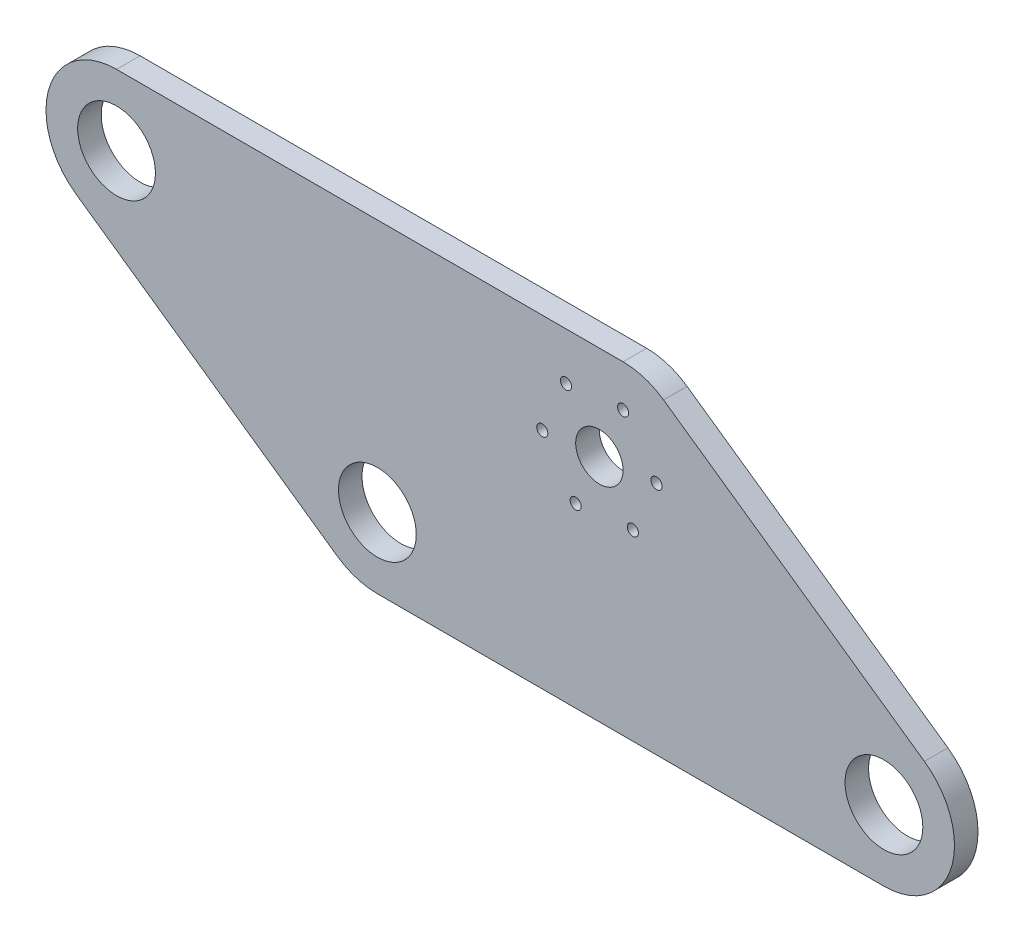
ISO-10303-21;
HEADER;
FILE_DESCRIPTION(('STEP AP214'),'2;1');
FILE_NAME('part.step','',(''),(''),'','','');
FILE_SCHEMA(('AUTOMOTIVE_DESIGN { 1 0 10303 214 1 1 1 1 }'));
ENDSEC;
DATA;
#1=APPLICATION_CONTEXT('core data for automotive mechanical design processes');
#2=APPLICATION_PROTOCOL_DEFINITION('international standard','automotive_design',2000,#1);
#3=PRODUCT_CONTEXT('',#1,'mechanical');
#4=PRODUCT('Part','Part','',(#3));
#5=PRODUCT_RELATED_PRODUCT_CATEGORY('part','',(#4));
#6=PRODUCT_DEFINITION_FORMATION('','',#4);
#7=PRODUCT_DEFINITION_CONTEXT('part definition',#1,'design');
#8=PRODUCT_DEFINITION('design','',#6,#7);
#9=PRODUCT_DEFINITION_SHAPE('','',#8);
#10=(LENGTH_UNIT() NAMED_UNIT(*) SI_UNIT(.MILLI.,.METRE.));
#11=(NAMED_UNIT(*) PLANE_ANGLE_UNIT() SI_UNIT($,.RADIAN.));
#12=(NAMED_UNIT(*) SI_UNIT($,.STERADIAN.) SOLID_ANGLE_UNIT());
#13=UNCERTAINTY_MEASURE_WITH_UNIT(LENGTH_MEASURE(1.E-05),#10,'distance_accuracy_value','');
#14=(GEOMETRIC_REPRESENTATION_CONTEXT(3) GLOBAL_UNCERTAINTY_ASSIGNED_CONTEXT((#13)) GLOBAL_UNIT_ASSIGNED_CONTEXT((#10,
#11,#12)) REPRESENTATION_CONTEXT('',''));
#15=CARTESIAN_POINT('',(0.,0.,0.));
#16=DIRECTION('',(0.,0.,1.));
#17=DIRECTION('',(1.,0.,0.));
#18=AXIS2_PLACEMENT_3D('',#15,#16,#17);
#19=CARTESIAN_POINT('',(-27.5612284503571,-62.0130488998987,-6.35));
#20=DIRECTION('',(0.573576436351041,0.819152044288995,0.));
#21=DIRECTION('',(-0.819152044288995,0.573576436351041,0.));
#22=AXIS2_PLACEMENT_3D('',#19,#20,#21);
#23=PLANE('',#22);
#24=DIRECTION('',(0.819152044288995,-0.573576436351041,0.));
#25=VECTOR('',#24,1.);
#26=CARTESIAN_POINT('',(-27.5612284503571,-62.0130488998987,0.));
#27=LINE('',#26,#25);
#28=CARTESIAN_POINT('',(-102.907750127468,-9.25484644370535,0.));
#29=VERTEX_POINT('',#28);
#30=CARTESIAN_POINT('',(-32.4814176346999,-58.5678953436041,0.));
#31=VERTEX_POINT('',#30);
#32=EDGE_CURVE('E168',#29,#31,#27,.T.);
#33=ORIENTED_EDGE('',*,*,#32,.F.);
#34=DIRECTION('',(0.,0.,1.));
#35=VECTOR('',#34,1.);
#36=CARTESIAN_POINT('',(-102.907750127468,-9.25484644370535,-6.35));
#37=LINE('',#36,#35);
#38=CARTESIAN_POINT('',(-102.907750127468,-9.25484644370535,-6.35));
#39=VERTEX_POINT('',#38);
#40=EDGE_CURVE('E49',#39,#29,#37,.T.);
#41=ORIENTED_EDGE('',*,*,#40,.F.);
#42=DIRECTION('',(0.819152044288995,-0.573576436351041,0.));
#43=VECTOR('',#42,1.);
#44=CARTESIAN_POINT('',(-27.5612284503571,-62.0130488998987,-6.35));
#45=LINE('',#44,#43);
#46=CARTESIAN_POINT('',(-32.4814176346999,-58.5678953436041,-6.35));
#47=VERTEX_POINT('',#46);
#48=EDGE_CURVE('E133',#39,#47,#45,.T.);
#49=ORIENTED_EDGE('',*,*,#48,.T.);
#50=DIRECTION('',(0.,0.,1.));
#51=VECTOR('',#50,1.);
#52=CARTESIAN_POINT('',(-32.4814176346999,-58.5678953436041,-6.35));
#53=LINE('',#52,#51);
#54=EDGE_CURVE('E11',#31,#47,#53,.F.);
#55=ORIENTED_EDGE('',*,*,#54,.F.);
#56=EDGE_LOOP('',(#33,#41,#49,#55));
#57=FACE_BOUND('',#56,.T.);
#58=ADVANCED_FACE('F41',(#57),#23,.F.);
#59=CARTESIAN_POINT('',(175.638771549643,-62.0130488998987,-6.35));
#60=DIRECTION('',(0.,1.,0.));
#61=DIRECTION('',(-1.,0.,0.));
#62=AXIS2_PLACEMENT_3D('',#59,#60,#61);
#63=PLANE('',#62);
#64=DIRECTION('',(1.,0.,0.));
#65=VECTOR('',#64,1.);
#66=CARTESIAN_POINT('',(175.638771549643,-62.0130488998987,-6.35));
#67=LINE('',#66,#65);
#68=CARTESIAN_POINT('',(-21.5547865222126,-62.0130488998987,-6.35));
#69=VERTEX_POINT('',#68);
#70=CARTESIAN_POINT('',(115.219890564623,-62.0130488998987,-6.35));
#71=VERTEX_POINT('',#70);
#72=EDGE_CURVE('E136',#69,#71,#67,.T.);
#73=ORIENTED_EDGE('',*,*,#72,.T.);
#74=DIRECTION('',(0.,0.,1.));
#75=VECTOR('',#74,1.);
#76=CARTESIAN_POINT('',(115.219890564623,-62.0130488998987,-6.35));
#77=LINE('',#76,#75);
#78=CARTESIAN_POINT('',(115.219890564623,-62.0130488998987,0.));
#79=VERTEX_POINT('',#78);
#80=EDGE_CURVE('E157',#79,#71,#77,.F.);
#81=ORIENTED_EDGE('',*,*,#80,.F.);
#82=DIRECTION('',(1.,0.,0.));
#83=VECTOR('',#82,1.);
#84=CARTESIAN_POINT('',(175.638771549643,-62.0130488998987,0.));
#85=LINE('',#84,#83);
#86=CARTESIAN_POINT('',(-21.5547865222126,-62.0130488998987,0.));
#87=VERTEX_POINT('',#86);
#88=EDGE_CURVE('E138',#87,#79,#85,.T.);
#89=ORIENTED_EDGE('',*,*,#88,.F.);
#90=DIRECTION('',(0.,0.,1.));
#91=VECTOR('',#90,1.);
#92=CARTESIAN_POINT('',(-21.5547865222126,-62.0130488998987,-6.35));
#93=LINE('',#92,#91);
#94=EDGE_CURVE('E159',#69,#87,#93,.T.);
#95=ORIENTED_EDGE('',*,*,#94,.F.);
#96=EDGE_LOOP('',(#73,#81,#89,#95));
#97=FACE_BOUND('',#96,.T.);
#98=ADVANCED_FACE('F254',(#97),#63,.F.);
#99=CARTESIAN_POINT('',(50.8,25.4,-6.35));
#100=DIRECTION('',(-0.573576436351041,-0.819152044288995,0.));
#101=DIRECTION('',(0.819152044288995,-0.573576436351041,0.));
#102=AXIS2_PLACEMENT_3D('',#99,#100,#101);
#103=PLANE('',#102);
#104=DIRECTION('',(-0.819152044288995,0.573576436351041,0.));
#105=VECTOR('',#104,1.);
#106=CARTESIAN_POINT('',(50.8,25.4,0.));
#107=LINE('',#106,#105);
#108=CARTESIAN_POINT('',(126.14652167711,-27.3582024561934,0.));
#109=VERTEX_POINT('',#108);
#110=CARTESIAN_POINT('',(55.7201891843428,21.9548464437054,0.));
#111=VERTEX_POINT('',#110);
#112=EDGE_CURVE('E114',#109,#111,#107,.T.);
#113=ORIENTED_EDGE('',*,*,#112,.F.);
#114=DIRECTION('',(0.,0.,1.));
#115=VECTOR('',#114,1.);
#116=CARTESIAN_POINT('',(126.14652167711,-27.3582024561934,-6.35));
#117=LINE('',#116,#115);
#118=CARTESIAN_POINT('',(126.14652167711,-27.3582024561934,-6.35));
#119=VERTEX_POINT('',#118);
#120=EDGE_CURVE('E118',#119,#109,#117,.T.);
#121=ORIENTED_EDGE('',*,*,#120,.F.);
#122=DIRECTION('',(-0.819152044288995,0.573576436351041,0.));
#123=VECTOR('',#122,1.);
#124=CARTESIAN_POINT('',(50.8,25.4,-6.35));
#125=LINE('',#124,#123);
#126=CARTESIAN_POINT('',(55.7201891843428,21.9548464437054,-6.35));
#127=VERTEX_POINT('',#126);
#128=EDGE_CURVE('E177',#119,#127,#125,.T.);
#129=ORIENTED_EDGE('',*,*,#128,.T.);
#130=DIRECTION('',(0.,0.,1.));
#131=VECTOR('',#130,1.);
#132=CARTESIAN_POINT('',(55.7201891843428,21.9548464437054,-6.35));
#133=LINE('',#132,#131);
#134=EDGE_CURVE('E150',#111,#127,#133,.F.);
#135=ORIENTED_EDGE('',*,*,#134,.F.);
#136=EDGE_LOOP('',(#113,#121,#129,#135));
#137=FACE_BOUND('',#136,.T.);
#138=ADVANCED_FACE('F259',(#137),#103,.F.);
#139=CARTESIAN_POINT('',(-152.4,25.4,-6.35));
#140=DIRECTION('',(0.,-1.,0.));
#141=DIRECTION('',(0.,0.,1.));
#142=AXIS2_PLACEMENT_3D('',#139,#140,#141);
#143=PLANE('',#142);
#144=DIRECTION('',(-1.,0.,0.));
#145=VECTOR('',#144,1.);
#146=CARTESIAN_POINT('',(-152.4,25.4,-6.35));
#147=LINE('',#146,#145);
#148=CARTESIAN_POINT('',(44.7935580718554,25.4,-6.35));
#149=VERTEX_POINT('',#148);
#150=CARTESIAN_POINT('',(-91.9811190149802,25.4,-6.35));
#151=VERTEX_POINT('',#150);
#152=EDGE_CURVE('E142',#149,#151,#147,.T.);
#153=ORIENTED_EDGE('',*,*,#152,.T.);
#154=DIRECTION('',(0.,0.,1.));
#155=VECTOR('',#154,1.);
#156=CARTESIAN_POINT('',(-91.9811190149802,25.4,-6.35));
#157=LINE('',#156,#155);
#158=CARTESIAN_POINT('',(-91.9811190149802,25.4,0.));
#159=VERTEX_POINT('',#158);
#160=EDGE_CURVE('E129',#159,#151,#157,.F.);
#161=ORIENTED_EDGE('',*,*,#160,.F.);
#162=DIRECTION('',(-1.,0.,0.));
#163=VECTOR('',#162,1.);
#164=CARTESIAN_POINT('',(-152.4,25.4,0.));
#165=LINE('',#164,#163);
#166=CARTESIAN_POINT('',(44.7935580718554,25.4,0.));
#167=VERTEX_POINT('',#166);
#168=EDGE_CURVE('E111',#167,#159,#165,.T.);
#169=ORIENTED_EDGE('',*,*,#168,.F.);
#170=DIRECTION('',(0.,0.,1.));
#171=VECTOR('',#170,1.);
#172=CARTESIAN_POINT('',(44.7935580718554,25.4,-6.35));
#173=LINE('',#172,#171);
#174=EDGE_CURVE('E122',#149,#167,#173,.T.);
#175=ORIENTED_EDGE('',*,*,#174,.F.);
#176=EDGE_LOOP('',(#153,#161,#169,#175));
#177=FACE_BOUND('',#176,.T.);
#178=ADVANCED_FACE('F131',(#177),#143,.F.);
#179=CARTESIAN_POINT('',(0.,0.,-6.35));
#180=DIRECTION('',(0.,0.,1.));
#181=DIRECTION('',(-1.,0.,0.));
#182=AXIS2_PLACEMENT_3D('',#179,#180,#181);
#183=PLANE('',#182);
#184=CARTESIAN_POINT('',(-91.9811190149802,6.35,-6.35));
#185=DIRECTION('',(0.,0.,1.));
#186=DIRECTION('',(1.,0.,0.));
#187=AXIS2_PLACEMENT_3D('',#184,#185,#186);
#188=CIRCLE('',#187,10.5);
#189=CARTESIAN_POINT('',(-81.4811190149802,6.35,-6.35));
#190=VERTEX_POINT('',#189);
#191=EDGE_CURVE('E173',#190,#190,#188,.T.);
#192=ORIENTED_EDGE('',*,*,#191,.T.);
#193=EDGE_LOOP('',(#192));
#194=FACE_BOUND('',#193,.T.);
#195=CARTESIAN_POINT('',(29.367867907288,12.6010680917624,-6.35));
#196=DIRECTION('',(0.,0.,1.));
#197=DIRECTION('',(1.,0.,0.));
#198=AXIS2_PLACEMENT_3D('',#195,#196,#197);
#199=CIRCLE('',#198,1.50000000000001);
#200=CARTESIAN_POINT('',(30.867867907288,12.6010680917624,-6.35));
#201=VERTEX_POINT('',#200);
#202=EDGE_CURVE('E211',#201,#201,#199,.T.);
#203=ORIENTED_EDGE('',*,*,#202,.T.);
#204=EDGE_LOOP('',(#203));
#205=FACE_BOUND('',#204,.T.);
#206=CARTESIAN_POINT('',(44.7935580718554,14.1170110150839,-6.35));
#207=DIRECTION('',(0.,0.,1.));
#208=DIRECTION('',(1.,0.,0.));
#209=AXIS2_PLACEMENT_3D('',#206,#207,#208);
#210=CIRCLE('',#209,1.5);
#211=CARTESIAN_POINT('',(46.2935580718554,14.1170110150839,-6.35));
#212=VERTEX_POINT('',#211);
#213=EDGE_CURVE('E198',#212,#212,#210,.T.);
#214=ORIENTED_EDGE('',*,*,#213,.T.);
#215=EDGE_LOOP('',(#214));
#216=FACE_BOUND('',#215,.T.);
#217=CARTESIAN_POINT('',(115.219890564623,-42.9630488998987,-6.35));
#218=DIRECTION('',(0.,0.,1.));
#219=DIRECTION('',(1.,0.,0.));
#220=AXIS2_PLACEMENT_3D('',#217,#218,#219);
#221=CIRCLE('',#220,10.5);
#222=CARTESIAN_POINT('',(125.719890564623,-42.9630488998987,-6.35));
#223=VERTEX_POINT('',#222);
#224=EDGE_CURVE('E186',#223,#223,#221,.T.);
#225=ORIENTED_EDGE('',*,*,#224,.T.);
#226=EDGE_LOOP('',(#225));
#227=FACE_BOUND('',#226,.T.);
#228=CARTESIAN_POINT('',(-21.5547865222126,-42.9630488998987,-6.35));
#229=DIRECTION('',(0.,0.,1.));
#230=DIRECTION('',(1.,0.,0.));
#231=AXIS2_PLACEMENT_3D('',#228,#229,#230);
#232=CIRCLE('',#231,10.5);
#233=CARTESIAN_POINT('',(-11.0547865222126,-42.9630488998987,-6.35));
#234=VERTEX_POINT('',#233);
#235=EDGE_CURVE('E185',#234,#234,#232,.T.);
#236=ORIENTED_EDGE('',*,*,#235,.T.);
#237=EDGE_LOOP('',(#236));
#238=FACE_BOUND('',#237,.T.);
#239=CARTESIAN_POINT('',(38.3935580718554,0.,-6.35));
#240=DIRECTION('',(0.,0.,1.));
#241=DIRECTION('',(1.,0.,0.));
#242=AXIS2_PLACEMENT_3D('',#239,#240,#241);
#243=CIRCLE('',#242,6.40000000000001);
#244=CARTESIAN_POINT('',(44.7935580718554,0.,-6.35));
#245=VERTEX_POINT('',#244);
#246=EDGE_CURVE('E192',#245,#245,#243,.T.);
#247=ORIENTED_EDGE('',*,*,#246,.T.);
#248=EDGE_LOOP('',(#247));
#249=FACE_BOUND('',#248,.T.);
#250=CARTESIAN_POINT('',(53.8192482364228,1.51594292332154,-6.35));
#251=DIRECTION('',(0.,0.,1.));
#252=DIRECTION('',(1.,0.,0.));
#253=AXIS2_PLACEMENT_3D('',#250,#251,#252);
#254=CIRCLE('',#253,1.5);
#255=CARTESIAN_POINT('',(55.3192482364228,1.51594292332154,-6.35));
#256=VERTEX_POINT('',#255);
#257=EDGE_CURVE('E199',#256,#256,#254,.T.);
#258=ORIENTED_EDGE('',*,*,#257,.T.);
#259=EDGE_LOOP('',(#258));
#260=FACE_BOUND('',#259,.T.);
#261=CARTESIAN_POINT('',(47.4192482364228,-12.6010680917623,-6.35));
#262=DIRECTION('',(0.,0.,1.));
#263=DIRECTION('',(1.,0.,0.));
#264=AXIS2_PLACEMENT_3D('',#261,#262,#263);
#265=CIRCLE('',#264,1.50000000000001);
#266=CARTESIAN_POINT('',(48.9192482364228,-12.6010680917623,-6.35));
#267=VERTEX_POINT('',#266);
#268=EDGE_CURVE('E223',#267,#267,#265,.T.);
#269=ORIENTED_EDGE('',*,*,#268,.T.);
#270=EDGE_LOOP('',(#269));
#271=FACE_BOUND('',#270,.T.);
#272=CARTESIAN_POINT('',(31.9935580718554,-14.1170110150839,-6.35));
#273=DIRECTION('',(0.,0.,1.));
#274=DIRECTION('',(1.,0.,0.));
#275=AXIS2_PLACEMENT_3D('',#272,#273,#274);
#276=CIRCLE('',#275,1.5);
#277=CARTESIAN_POINT('',(33.4935580718554,-14.1170110150839,-6.35));
#278=VERTEX_POINT('',#277);
#279=EDGE_CURVE('E217',#278,#278,#276,.T.);
#280=ORIENTED_EDGE('',*,*,#279,.T.);
#281=EDGE_LOOP('',(#280));
#282=FACE_BOUND('',#281,.T.);
#283=CARTESIAN_POINT('',(22.967867907288,-1.51594292332154,-6.35));
#284=DIRECTION('',(0.,0.,1.));
#285=DIRECTION('',(1.,0.,0.));
#286=AXIS2_PLACEMENT_3D('',#283,#284,#285);
#287=CIRCLE('',#286,1.5);
#288=CARTESIAN_POINT('',(24.467867907288,-1.51594292332154,-6.35));
#289=VERTEX_POINT('',#288);
#290=EDGE_CURVE('E210',#289,#289,#287,.T.);
#291=ORIENTED_EDGE('',*,*,#290,.T.);
#292=EDGE_LOOP('',(#291));
#293=FACE_BOUND('',#292,.T.);
#294=ORIENTED_EDGE('',*,*,#128,.F.);
#295=CARTESIAN_POINT('',(115.219890564623,-42.9630488998987,-6.35));
#296=DIRECTION('',(0.,0.,-1.));
#297=DIRECTION('',(-1.,0.,0.));
#298=AXIS2_PLACEMENT_3D('',#295,#296,#297);
#299=CIRCLE('',#298,19.05);
#300=EDGE_CURVE('E56',#71,#119,#299,.F.);
#301=ORIENTED_EDGE('',*,*,#300,.F.);
#302=ORIENTED_EDGE('',*,*,#72,.F.);
#303=CARTESIAN_POINT('',(-21.5547865222126,-42.9630488998987,-6.35));
#304=DIRECTION('',(0.,0.,-1.));
#305=DIRECTION('',(-1.,0.,0.));
#306=AXIS2_PLACEMENT_3D('',#303,#304,#305);
#307=CIRCLE('',#306,19.05);
#308=EDGE_CURVE('E63',#47,#69,#307,.F.);
#309=ORIENTED_EDGE('',*,*,#308,.F.);
#310=ORIENTED_EDGE('',*,*,#48,.F.);
#311=CARTESIAN_POINT('',(-91.9811190149802,6.35,-6.35));
#312=DIRECTION('',(0.,0.,-1.));
#313=DIRECTION('',(-1.,0.,0.));
#314=AXIS2_PLACEMENT_3D('',#311,#312,#313);
#315=CIRCLE('',#314,19.05);
#316=EDGE_CURVE('E152',#151,#39,#315,.F.);
#317=ORIENTED_EDGE('',*,*,#316,.F.);
#318=ORIENTED_EDGE('',*,*,#152,.F.);
#319=CARTESIAN_POINT('',(44.7935580718554,6.35,-6.35));
#320=DIRECTION('',(0.,0.,-1.));
#321=DIRECTION('',(-1.,0.,0.));
#322=AXIS2_PLACEMENT_3D('',#319,#320,#321);
#323=CIRCLE('',#322,19.05);
#324=EDGE_CURVE('E124',#127,#149,#323,.F.);
#325=ORIENTED_EDGE('',*,*,#324,.F.);
#326=EDGE_LOOP('',(#294,#301,#302,#309,#310,#317,#318,#325));
#327=FACE_BOUND('',#326,.T.);
#328=ADVANCED_FACE('F239',(#194,#205,#216,#227,#238,#249,#260,#271,#282,#293,#327),#183,.F.);
#329=CARTESIAN_POINT('',(0.,0.,0.));
#330=DIRECTION('',(0.,0.,1.));
#331=DIRECTION('',(-1.,0.,0.));
#332=AXIS2_PLACEMENT_3D('',#329,#330,#331);
#333=PLANE('',#332);
#334=CARTESIAN_POINT('',(-91.9811190149802,6.35,0.));
#335=DIRECTION('',(0.,0.,1.));
#336=DIRECTION('',(1.,0.,0.));
#337=AXIS2_PLACEMENT_3D('',#334,#335,#336);
#338=CIRCLE('',#337,10.5);
#339=CARTESIAN_POINT('',(-81.4811190149802,6.35,0.));
#340=VERTEX_POINT('',#339);
#341=EDGE_CURVE('E169',#340,#340,#338,.T.);
#342=ORIENTED_EDGE('',*,*,#341,.F.);
#343=EDGE_LOOP('',(#342));
#344=FACE_BOUND('',#343,.T.);
#345=CARTESIAN_POINT('',(29.367867907288,12.6010680917624,0.));
#346=DIRECTION('',(0.,0.,1.));
#347=DIRECTION('',(1.,0.,0.));
#348=AXIS2_PLACEMENT_3D('',#345,#346,#347);
#349=CIRCLE('',#348,1.50000000000001);
#350=CARTESIAN_POINT('',(30.867867907288,12.6010680917624,0.));
#351=VERTEX_POINT('',#350);
#352=EDGE_CURVE('E231',#351,#351,#349,.T.);
#353=ORIENTED_EDGE('',*,*,#352,.F.);
#354=EDGE_LOOP('',(#353));
#355=FACE_BOUND('',#354,.T.);
#356=CARTESIAN_POINT('',(44.7935580718554,14.1170110150839,0.));
#357=DIRECTION('',(0.,0.,1.));
#358=DIRECTION('',(1.,0.,0.));
#359=AXIS2_PLACEMENT_3D('',#356,#357,#358);
#360=CIRCLE('',#359,1.5);
#361=CARTESIAN_POINT('',(46.2935580718554,14.1170110150839,0.));
#362=VERTEX_POINT('',#361);
#363=EDGE_CURVE('E195',#362,#362,#360,.T.);
#364=ORIENTED_EDGE('',*,*,#363,.F.);
#365=EDGE_LOOP('',(#364));
#366=FACE_BOUND('',#365,.T.);
#367=CARTESIAN_POINT('',(115.219890564623,-42.9630488998987,0.));
#368=DIRECTION('',(0.,0.,1.));
#369=DIRECTION('',(1.,0.,0.));
#370=AXIS2_PLACEMENT_3D('',#367,#368,#369);
#371=CIRCLE('',#370,10.5);
#372=CARTESIAN_POINT('',(125.719890564623,-42.9630488998987,0.));
#373=VERTEX_POINT('',#372);
#374=EDGE_CURVE('E202',#373,#373,#371,.T.);
#375=ORIENTED_EDGE('',*,*,#374,.F.);
#376=EDGE_LOOP('',(#375));
#377=FACE_BOUND('',#376,.T.);
#378=CARTESIAN_POINT('',(-21.5547865222126,-42.9630488998987,0.));
#379=DIRECTION('',(0.,0.,1.));
#380=DIRECTION('',(1.,0.,0.));
#381=AXIS2_PLACEMENT_3D('',#378,#379,#380);
#382=CIRCLE('',#381,10.5);
#383=CARTESIAN_POINT('',(-11.0547865222126,-42.9630488998987,0.));
#384=VERTEX_POINT('',#383);
#385=EDGE_CURVE('E182',#384,#384,#382,.T.);
#386=ORIENTED_EDGE('',*,*,#385,.F.);
#387=EDGE_LOOP('',(#386));
#388=FACE_BOUND('',#387,.T.);
#389=CARTESIAN_POINT('',(38.3935580718554,0.,0.));
#390=DIRECTION('',(0.,0.,1.));
#391=DIRECTION('',(1.,0.,0.));
#392=AXIS2_PLACEMENT_3D('',#389,#390,#391);
#393=CIRCLE('',#392,6.40000000000001);
#394=CARTESIAN_POINT('',(44.7935580718554,0.,0.));
#395=VERTEX_POINT('',#394);
#396=EDGE_CURVE('E189',#395,#395,#393,.T.);
#397=ORIENTED_EDGE('',*,*,#396,.F.);
#398=EDGE_LOOP('',(#397));
#399=FACE_BOUND('',#398,.T.);
#400=CARTESIAN_POINT('',(53.8192482364228,1.51594292332154,0.));
#401=DIRECTION('',(0.,0.,1.));
#402=DIRECTION('',(1.,0.,0.));
#403=AXIS2_PLACEMENT_3D('',#400,#401,#402);
#404=CIRCLE('',#403,1.5);
#405=CARTESIAN_POINT('',(55.3192482364228,1.51594292332154,0.));
#406=VERTEX_POINT('',#405);
#407=EDGE_CURVE('E226',#406,#406,#404,.T.);
#408=ORIENTED_EDGE('',*,*,#407,.F.);
#409=EDGE_LOOP('',(#408));
#410=FACE_BOUND('',#409,.T.);
#411=CARTESIAN_POINT('',(47.4192482364228,-12.6010680917623,0.));
#412=DIRECTION('',(0.,0.,1.));
#413=DIRECTION('',(1.,0.,0.));
#414=AXIS2_PLACEMENT_3D('',#411,#412,#413);
#415=CIRCLE('',#414,1.50000000000001);
#416=CARTESIAN_POINT('',(48.9192482364228,-12.6010680917623,0.));
#417=VERTEX_POINT('',#416);
#418=EDGE_CURVE('E220',#417,#417,#415,.T.);
#419=ORIENTED_EDGE('',*,*,#418,.F.);
#420=EDGE_LOOP('',(#419));
#421=FACE_BOUND('',#420,.T.);
#422=CARTESIAN_POINT('',(31.9935580718554,-14.1170110150839,0.));
#423=DIRECTION('',(0.,0.,1.));
#424=DIRECTION('',(1.,0.,0.));
#425=AXIS2_PLACEMENT_3D('',#422,#423,#424);
#426=CIRCLE('',#425,1.5);
#427=CARTESIAN_POINT('',(33.4935580718554,-14.1170110150839,0.));
#428=VERTEX_POINT('',#427);
#429=EDGE_CURVE('E214',#428,#428,#426,.T.);
#430=ORIENTED_EDGE('',*,*,#429,.F.);
#431=EDGE_LOOP('',(#430));
#432=FACE_BOUND('',#431,.T.);
#433=CARTESIAN_POINT('',(22.967867907288,-1.51594292332154,0.));
#434=DIRECTION('',(0.,0.,1.));
#435=DIRECTION('',(1.,0.,0.));
#436=AXIS2_PLACEMENT_3D('',#433,#434,#435);
#437=CIRCLE('',#436,1.5);
#438=CARTESIAN_POINT('',(24.467867907288,-1.51594292332154,0.));
#439=VERTEX_POINT('',#438);
#440=EDGE_CURVE('E207',#439,#439,#437,.T.);
#441=ORIENTED_EDGE('',*,*,#440,.F.);
#442=EDGE_LOOP('',(#441));
#443=FACE_BOUND('',#442,.T.);
#444=ORIENTED_EDGE('',*,*,#168,.T.);
#445=CARTESIAN_POINT('',(-91.9811190149802,6.35,0.));
#446=DIRECTION('',(0.,0.,-1.));
#447=DIRECTION('',(-1.,0.,0.));
#448=AXIS2_PLACEMENT_3D('',#445,#446,#447);
#449=CIRCLE('',#448,19.05);
#450=EDGE_CURVE('E128',#29,#159,#449,.T.);
#451=ORIENTED_EDGE('',*,*,#450,.F.);
#452=ORIENTED_EDGE('',*,*,#32,.T.);
#453=CARTESIAN_POINT('',(-21.5547865222126,-42.9630488998987,0.));
#454=DIRECTION('',(0.,0.,-1.));
#455=DIRECTION('',(-1.,0.,0.));
#456=AXIS2_PLACEMENT_3D('',#453,#454,#455);
#457=CIRCLE('',#456,19.05);
#458=EDGE_CURVE('E119',#87,#31,#457,.T.);
#459=ORIENTED_EDGE('',*,*,#458,.F.);
#460=ORIENTED_EDGE('',*,*,#88,.T.);
#461=CARTESIAN_POINT('',(115.219890564623,-42.9630488998987,0.));
#462=DIRECTION('',(0.,0.,-1.));
#463=DIRECTION('',(-1.,0.,0.));
#464=AXIS2_PLACEMENT_3D('',#461,#462,#463);
#465=CIRCLE('',#464,19.05);
#466=EDGE_CURVE('E145',#109,#79,#465,.T.);
#467=ORIENTED_EDGE('',*,*,#466,.F.);
#468=ORIENTED_EDGE('',*,*,#112,.T.);
#469=CARTESIAN_POINT('',(44.7935580718554,6.35,0.));
#470=DIRECTION('',(0.,0.,-1.));
#471=DIRECTION('',(-1.,0.,0.));
#472=AXIS2_PLACEMENT_3D('',#469,#470,#471);
#473=CIRCLE('',#472,19.05);
#474=EDGE_CURVE('E107',#167,#111,#473,.T.);
#475=ORIENTED_EDGE('',*,*,#474,.F.);
#476=EDGE_LOOP('',(#444,#451,#452,#459,#460,#467,#468,#475));
#477=FACE_BOUND('',#476,.T.);
#478=ADVANCED_FACE('F109',(#344,#355,#366,#377,#388,#399,#410,#421,#432,#443,#477),#333,.T.);
#479=CARTESIAN_POINT('',(44.7935580718554,6.35,-6.35));
#480=DIRECTION('',(0.,0.,1.));
#481=DIRECTION('',(-1.,0.,0.));
#482=AXIS2_PLACEMENT_3D('',#479,#480,#481);
#483=CYLINDRICAL_SURFACE('',#482,19.05);
#484=ORIENTED_EDGE('',*,*,#324,.T.);
#485=ORIENTED_EDGE('',*,*,#174,.T.);
#486=ORIENTED_EDGE('',*,*,#474,.T.);
#487=ORIENTED_EDGE('',*,*,#134,.T.);
#488=EDGE_LOOP('',(#484,#485,#486,#487));
#489=FACE_BOUND('',#488,.T.);
#490=ADVANCED_FACE('F123',(#489),#483,.T.);
#491=CARTESIAN_POINT('',(-21.5547865222126,-42.9630488998987,-6.35));
#492=DIRECTION('',(0.,0.,1.));
#493=DIRECTION('',(-1.,0.,0.));
#494=AXIS2_PLACEMENT_3D('',#491,#492,#493);
#495=CYLINDRICAL_SURFACE('',#494,19.05);
#496=ORIENTED_EDGE('',*,*,#308,.T.);
#497=ORIENTED_EDGE('',*,*,#94,.T.);
#498=ORIENTED_EDGE('',*,*,#458,.T.);
#499=ORIENTED_EDGE('',*,*,#54,.T.);
#500=EDGE_LOOP('',(#496,#497,#498,#499));
#501=FACE_BOUND('',#500,.T.);
#502=ADVANCED_FACE('F266',(#501),#495,.T.);
#503=CARTESIAN_POINT('',(115.219890564623,-42.9630488998987,-6.35));
#504=DIRECTION('',(0.,0.,1.));
#505=DIRECTION('',(-1.,0.,0.));
#506=AXIS2_PLACEMENT_3D('',#503,#504,#505);
#507=CYLINDRICAL_SURFACE('',#506,19.05);
#508=ORIENTED_EDGE('',*,*,#300,.T.);
#509=ORIENTED_EDGE('',*,*,#120,.T.);
#510=ORIENTED_EDGE('',*,*,#466,.T.);
#511=ORIENTED_EDGE('',*,*,#80,.T.);
#512=EDGE_LOOP('',(#508,#509,#510,#511));
#513=FACE_BOUND('',#512,.T.);
#514=ADVANCED_FACE('F268',(#513),#507,.T.);
#515=CARTESIAN_POINT('',(-91.9811190149802,6.35,-6.35));
#516=DIRECTION('',(0.,0.,1.));
#517=DIRECTION('',(-1.,0.,0.));
#518=AXIS2_PLACEMENT_3D('',#515,#516,#517);
#519=CYLINDRICAL_SURFACE('',#518,19.05);
#520=ORIENTED_EDGE('',*,*,#316,.T.);
#521=ORIENTED_EDGE('',*,*,#40,.T.);
#522=ORIENTED_EDGE('',*,*,#450,.T.);
#523=ORIENTED_EDGE('',*,*,#160,.T.);
#524=EDGE_LOOP('',(#520,#521,#522,#523));
#525=FACE_BOUND('',#524,.T.);
#526=ADVANCED_FACE('F43',(#525),#519,.T.);
#527=CARTESIAN_POINT('',(22.967867907288,-1.51594292332154,0.));
#528=DIRECTION('',(0.,0.,-1.));
#529=DIRECTION('',(1.,0.,0.));
#530=AXIS2_PLACEMENT_3D('',#527,#528,#529);
#531=CYLINDRICAL_SURFACE('',#530,1.5);
#532=ORIENTED_EDGE('',*,*,#440,.T.);
#533=EDGE_LOOP('',(#532));
#534=FACE_BOUND('',#533,.T.);
#535=ORIENTED_EDGE('',*,*,#290,.F.);
#536=EDGE_LOOP('',(#535));
#537=FACE_BOUND('',#536,.T.);
#538=ADVANCED_FACE('F274',(#534,#537),#531,.F.);
#539=CARTESIAN_POINT('',(31.9935580718554,-14.1170110150839,0.));
#540=DIRECTION('',(0.,0.,-1.));
#541=DIRECTION('',(1.,0.,0.));
#542=AXIS2_PLACEMENT_3D('',#539,#540,#541);
#543=CYLINDRICAL_SURFACE('',#542,1.5);
#544=ORIENTED_EDGE('',*,*,#429,.T.);
#545=EDGE_LOOP('',(#544));
#546=FACE_BOUND('',#545,.T.);
#547=ORIENTED_EDGE('',*,*,#279,.F.);
#548=EDGE_LOOP('',(#547));
#549=FACE_BOUND('',#548,.T.);
#550=ADVANCED_FACE('F307',(#546,#549),#543,.F.);
#551=CARTESIAN_POINT('',(47.4192482364228,-12.6010680917623,0.));
#552=DIRECTION('',(0.,0.,-1.));
#553=DIRECTION('',(1.,0.,0.));
#554=AXIS2_PLACEMENT_3D('',#551,#552,#553);
#555=CYLINDRICAL_SURFACE('',#554,1.50000000000001);
#556=ORIENTED_EDGE('',*,*,#418,.T.);
#557=EDGE_LOOP('',(#556));
#558=FACE_BOUND('',#557,.T.);
#559=ORIENTED_EDGE('',*,*,#268,.F.);
#560=EDGE_LOOP('',(#559));
#561=FACE_BOUND('',#560,.T.);
#562=ADVANCED_FACE('F311',(#558,#561),#555,.F.);
#563=CARTESIAN_POINT('',(53.8192482364228,1.51594292332154,0.));
#564=DIRECTION('',(0.,0.,-1.));
#565=DIRECTION('',(1.,0.,0.));
#566=AXIS2_PLACEMENT_3D('',#563,#564,#565);
#567=CYLINDRICAL_SURFACE('',#566,1.5);
#568=ORIENTED_EDGE('',*,*,#407,.T.);
#569=EDGE_LOOP('',(#568));
#570=FACE_BOUND('',#569,.T.);
#571=ORIENTED_EDGE('',*,*,#257,.F.);
#572=EDGE_LOOP('',(#571));
#573=FACE_BOUND('',#572,.T.);
#574=ADVANCED_FACE('F297',(#570,#573),#567,.F.);
#575=CARTESIAN_POINT('',(38.3935580718554,0.,0.));
#576=DIRECTION('',(0.,0.,-1.));
#577=DIRECTION('',(1.,0.,0.));
#578=AXIS2_PLACEMENT_3D('',#575,#576,#577);
#579=CYLINDRICAL_SURFACE('',#578,6.40000000000001);
#580=ORIENTED_EDGE('',*,*,#396,.T.);
#581=EDGE_LOOP('',(#580));
#582=FACE_BOUND('',#581,.T.);
#583=ORIENTED_EDGE('',*,*,#246,.F.);
#584=EDGE_LOOP('',(#583));
#585=FACE_BOUND('',#584,.T.);
#586=ADVANCED_FACE('F293',(#582,#585),#579,.F.);
#587=CARTESIAN_POINT('',(-21.5547865222126,-42.9630488998987,0.));
#588=DIRECTION('',(0.,0.,-1.));
#589=DIRECTION('',(1.,0.,0.));
#590=AXIS2_PLACEMENT_3D('',#587,#588,#589);
#591=CYLINDRICAL_SURFACE('',#590,10.5);
#592=ORIENTED_EDGE('',*,*,#385,.T.);
#593=EDGE_LOOP('',(#592));
#594=FACE_BOUND('',#593,.T.);
#595=ORIENTED_EDGE('',*,*,#235,.F.);
#596=EDGE_LOOP('',(#595));
#597=FACE_BOUND('',#596,.T.);
#598=ADVANCED_FACE('F289',(#594,#597),#591,.F.);
#599=CARTESIAN_POINT('',(115.219890564623,-42.9630488998987,0.));
#600=DIRECTION('',(0.,0.,-1.));
#601=DIRECTION('',(1.,0.,0.));
#602=AXIS2_PLACEMENT_3D('',#599,#600,#601);
#603=CYLINDRICAL_SURFACE('',#602,10.5);
#604=ORIENTED_EDGE('',*,*,#374,.T.);
#605=EDGE_LOOP('',(#604));
#606=FACE_BOUND('',#605,.T.);
#607=ORIENTED_EDGE('',*,*,#224,.F.);
#608=EDGE_LOOP('',(#607));
#609=FACE_BOUND('',#608,.T.);
#610=ADVANCED_FACE('F292',(#606,#609),#603,.F.);
#611=CARTESIAN_POINT('',(44.7935580718554,14.1170110150839,0.));
#612=DIRECTION('',(0.,0.,-1.));
#613=DIRECTION('',(1.,0.,0.));
#614=AXIS2_PLACEMENT_3D('',#611,#612,#613);
#615=CYLINDRICAL_SURFACE('',#614,1.5);
#616=ORIENTED_EDGE('',*,*,#363,.T.);
#617=EDGE_LOOP('',(#616));
#618=FACE_BOUND('',#617,.T.);
#619=ORIENTED_EDGE('',*,*,#213,.F.);
#620=EDGE_LOOP('',(#619));
#621=FACE_BOUND('',#620,.T.);
#622=ADVANCED_FACE('F250',(#618,#621),#615,.F.);
#623=CARTESIAN_POINT('',(29.367867907288,12.6010680917624,0.));
#624=DIRECTION('',(0.,0.,-1.));
#625=DIRECTION('',(1.,0.,0.));
#626=AXIS2_PLACEMENT_3D('',#623,#624,#625);
#627=CYLINDRICAL_SURFACE('',#626,1.50000000000001);
#628=ORIENTED_EDGE('',*,*,#352,.T.);
#629=EDGE_LOOP('',(#628));
#630=FACE_BOUND('',#629,.T.);
#631=ORIENTED_EDGE('',*,*,#202,.F.);
#632=EDGE_LOOP('',(#631));
#633=FACE_BOUND('',#632,.T.);
#634=ADVANCED_FACE('F244',(#630,#633),#627,.F.);
#635=CARTESIAN_POINT('',(-91.9811190149802,6.35,0.));
#636=DIRECTION('',(0.,0.,-1.));
#637=DIRECTION('',(1.,0.,0.));
#638=AXIS2_PLACEMENT_3D('',#635,#636,#637);
#639=CYLINDRICAL_SURFACE('',#638,10.5);
#640=ORIENTED_EDGE('',*,*,#341,.T.);
#641=EDGE_LOOP('',(#640));
#642=FACE_BOUND('',#641,.T.);
#643=ORIENTED_EDGE('',*,*,#191,.F.);
#644=EDGE_LOOP('',(#643));
#645=FACE_BOUND('',#644,.T.);
#646=ADVANCED_FACE('F242',(#642,#645),#639,.F.);
#647=CLOSED_SHELL('',(#58,#98,#138,#178,#328,#478,#490,#502,#514,#526,#538,#550,#562,#574,#586,
#598,#610,#622,#634,#646));
#648=MANIFOLD_SOLID_BREP('B2',#647);
#649=ADVANCED_BREP_SHAPE_REPRESENTATION('',(#18,#648),#14);
#650=SHAPE_DEFINITION_REPRESENTATION(#9,#649);
ENDSEC;
END-ISO-10303-21;
